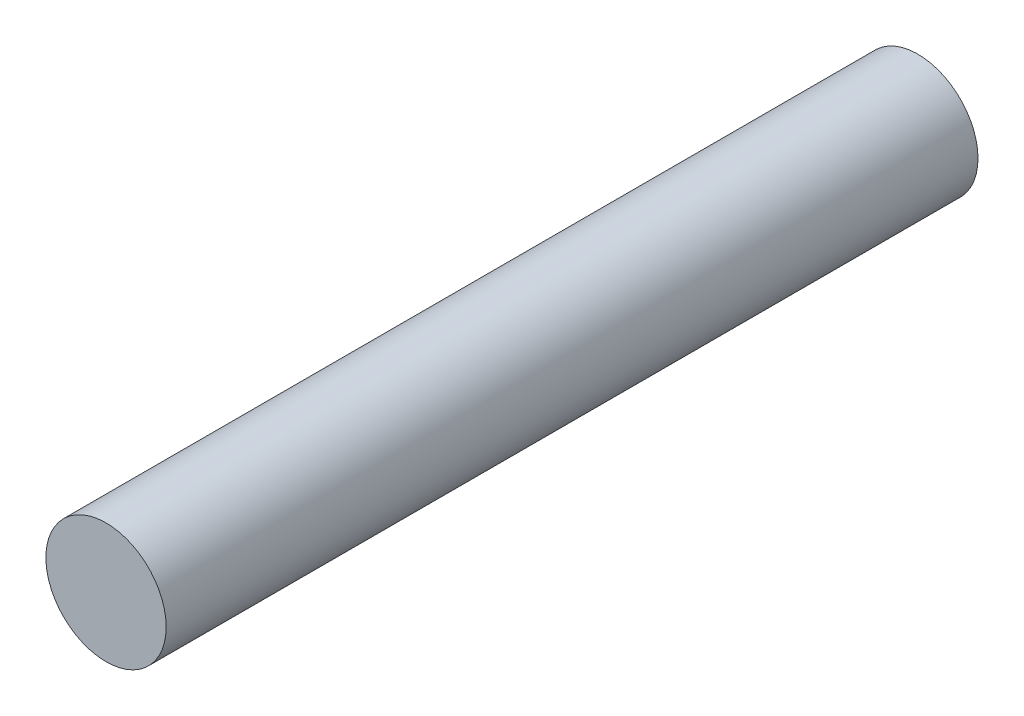
ISO-10303-21;
HEADER;
FILE_DESCRIPTION(('STEP AP214'),'2;1');
FILE_NAME('part.step','',(''),(''),'','','');
FILE_SCHEMA(('AUTOMOTIVE_DESIGN { 1 0 10303 214 1 1 1 1 }'));
ENDSEC;
DATA;
#1=APPLICATION_CONTEXT('core data for automotive mechanical design processes');
#2=APPLICATION_PROTOCOL_DEFINITION('international standard','automotive_design',2000,#1);
#3=PRODUCT_CONTEXT('',#1,'mechanical');
#4=PRODUCT('Part','Part','',(#3));
#5=PRODUCT_RELATED_PRODUCT_CATEGORY('part','',(#4));
#6=PRODUCT_DEFINITION_FORMATION('','',#4);
#7=PRODUCT_DEFINITION_CONTEXT('part definition',#1,'design');
#8=PRODUCT_DEFINITION('design','',#6,#7);
#9=PRODUCT_DEFINITION_SHAPE('','',#8);
#10=(LENGTH_UNIT() NAMED_UNIT(*) SI_UNIT(.MILLI.,.METRE.));
#11=(NAMED_UNIT(*) PLANE_ANGLE_UNIT() SI_UNIT($,.RADIAN.));
#12=(NAMED_UNIT(*) SI_UNIT($,.STERADIAN.) SOLID_ANGLE_UNIT());
#13=UNCERTAINTY_MEASURE_WITH_UNIT(LENGTH_MEASURE(1.E-05),#10,'distance_accuracy_value','');
#14=(GEOMETRIC_REPRESENTATION_CONTEXT(3) GLOBAL_UNCERTAINTY_ASSIGNED_CONTEXT((#13)) GLOBAL_UNIT_ASSIGNED_CONTEXT((#10,
#11,#12)) REPRESENTATION_CONTEXT('',''));
#15=CARTESIAN_POINT('',(0.,0.,0.));
#16=DIRECTION('',(0.,0.,1.));
#17=DIRECTION('',(1.,0.,0.));
#18=AXIS2_PLACEMENT_3D('',#15,#16,#17);
#19=CARTESIAN_POINT('',(-52.8202799318044,32.8842902711324,54.));
#20=DIRECTION('',(0.,0.,-1.));
#21=DIRECTION('',(-1.,0.,0.));
#22=AXIS2_PLACEMENT_3D('',#19,#20,#21);
#23=CYLINDRICAL_SURFACE('',#22,4.00000000000001);
#24=CARTESIAN_POINT('',(-52.8202799318044,32.8842902711324,54.));
#25=DIRECTION('',(0.,0.,1.));
#26=DIRECTION('',(1.,0.,0.));
#27=AXIS2_PLACEMENT_3D('',#24,#25,#26);
#28=CIRCLE('',#27,4.00000000000001);
#29=CARTESIAN_POINT('',(-48.8202799318044,32.8842902711324,54.));
#30=VERTEX_POINT('',#29);
#31=EDGE_CURVE('E10',#30,#30,#28,.T.);
#32=ORIENTED_EDGE('',*,*,#31,.F.);
#33=EDGE_LOOP('',(#32));
#34=FACE_BOUND('',#33,.T.);
#35=CARTESIAN_POINT('',(-52.8202799318044,32.8842902711324,0.));
#36=DIRECTION('',(0.,0.,1.));
#37=DIRECTION('',(1.,0.,0.));
#38=AXIS2_PLACEMENT_3D('',#35,#36,#37);
#39=CIRCLE('',#38,4.00000000000001);
#40=CARTESIAN_POINT('',(-48.8202799318044,32.8842902711324,0.));
#41=VERTEX_POINT('',#40);
#42=EDGE_CURVE('E34',#41,#41,#39,.T.);
#43=ORIENTED_EDGE('',*,*,#42,.T.);
#44=EDGE_LOOP('',(#43));
#45=FACE_BOUND('',#44,.T.);
#46=ADVANCED_FACE('F31',(#34,#45),#23,.T.);
#47=CARTESIAN_POINT('',(-52.8202799318044,32.8842902711324,54.));
#48=DIRECTION('',(0.,0.,1.));
#49=DIRECTION('',(1.,0.,0.));
#50=AXIS2_PLACEMENT_3D('',#47,#48,#49);
#51=PLANE('',#50);
#52=ORIENTED_EDGE('',*,*,#31,.T.);
#53=EDGE_LOOP('',(#52));
#54=FACE_BOUND('',#53,.T.);
#55=ADVANCED_FACE('F46',(#54),#51,.T.);
#56=CARTESIAN_POINT('',(-52.8202799318044,32.8842902711324,0.));
#57=DIRECTION('',(0.,0.,1.));
#58=DIRECTION('',(1.,0.,0.));
#59=AXIS2_PLACEMENT_3D('',#56,#57,#58);
#60=PLANE('',#59);
#61=ORIENTED_EDGE('',*,*,#42,.F.);
#62=EDGE_LOOP('',(#61));
#63=FACE_BOUND('',#62,.T.);
#64=ADVANCED_FACE('F44',(#63),#60,.F.);
#65=CLOSED_SHELL('',(#46,#55,#64));
#66=MANIFOLD_SOLID_BREP('B2',#65);
#67=ADVANCED_BREP_SHAPE_REPRESENTATION('',(#18,#66),#14);
#68=SHAPE_DEFINITION_REPRESENTATION(#9,#67);
ENDSEC;
END-ISO-10303-21;
